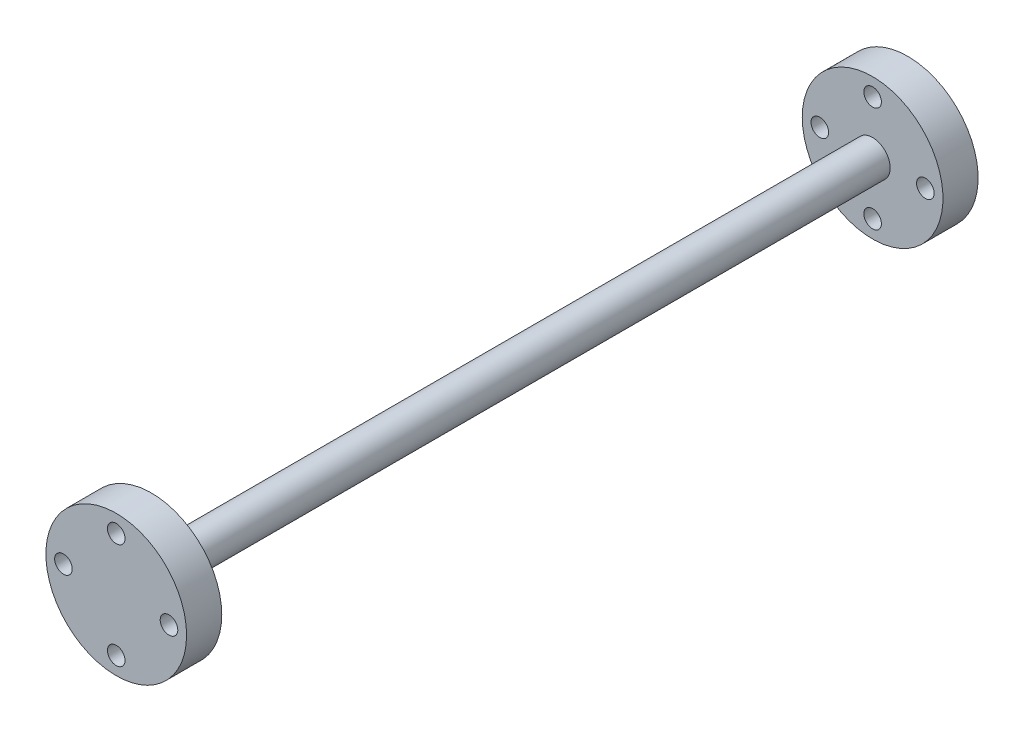
ISO-10303-21;
HEADER;
FILE_DESCRIPTION(('STEP AP214'),'2;1');
FILE_NAME('part.step','',(''),(''),'','','');
FILE_SCHEMA(('AUTOMOTIVE_DESIGN { 1 0 10303 214 1 1 1 1 }'));
ENDSEC;
DATA;
#1=APPLICATION_CONTEXT('core data for automotive mechanical design processes');
#2=APPLICATION_PROTOCOL_DEFINITION('international standard','automotive_design',2000,#1);
#3=PRODUCT_CONTEXT('',#1,'mechanical');
#4=PRODUCT('Part','Part','',(#3));
#5=PRODUCT_RELATED_PRODUCT_CATEGORY('part','',(#4));
#6=PRODUCT_DEFINITION_FORMATION('','',#4);
#7=PRODUCT_DEFINITION_CONTEXT('part definition',#1,'design');
#8=PRODUCT_DEFINITION('design','',#6,#7);
#9=PRODUCT_DEFINITION_SHAPE('','',#8);
#10=(LENGTH_UNIT() NAMED_UNIT(*) SI_UNIT(.MILLI.,.METRE.));
#11=(NAMED_UNIT(*) PLANE_ANGLE_UNIT() SI_UNIT($,.RADIAN.));
#12=(NAMED_UNIT(*) SI_UNIT($,.STERADIAN.) SOLID_ANGLE_UNIT());
#13=UNCERTAINTY_MEASURE_WITH_UNIT(LENGTH_MEASURE(1.E-05),#10,'distance_accuracy_value','');
#14=(GEOMETRIC_REPRESENTATION_CONTEXT(3) GLOBAL_UNCERTAINTY_ASSIGNED_CONTEXT((#13)) GLOBAL_UNIT_ASSIGNED_CONTEXT((#10,
#11,#12)) REPRESENTATION_CONTEXT('',''));
#15=CARTESIAN_POINT('',(0.,0.,0.));
#16=DIRECTION('',(0.,0.,1.));
#17=DIRECTION('',(1.,0.,0.));
#18=AXIS2_PLACEMENT_3D('',#15,#16,#17);
#19=CARTESIAN_POINT('',(0.,0.,-100.));
#20=DIRECTION('',(0.,0.,1.));
#21=DIRECTION('',(1.,0.,0.));
#22=AXIS2_PLACEMENT_3D('',#19,#20,#21);
#23=CYLINDRICAL_SURFACE('',#22,5.);
#24=CARTESIAN_POINT('',(0.,0.,-100.));
#25=DIRECTION('',(0.,0.,-1.));
#26=DIRECTION('',(-1.,0.,0.));
#27=AXIS2_PLACEMENT_3D('',#24,#25,#26);
#28=CIRCLE('',#27,5.);
#29=CARTESIAN_POINT('',(-5.,0.,-100.));
#30=VERTEX_POINT('',#29);
#31=EDGE_CURVE('E70',#30,#30,#28,.F.);
#32=ORIENTED_EDGE('',*,*,#31,.T.);
#33=EDGE_LOOP('',(#32));
#34=FACE_BOUND('',#33,.T.);
#35=CARTESIAN_POINT('',(0.,0.,105.));
#36=DIRECTION('',(0.,0.,1.));
#37=DIRECTION('',(1.,0.,0.));
#38=AXIS2_PLACEMENT_3D('',#35,#36,#37);
#39=CIRCLE('',#38,5.);
#40=CARTESIAN_POINT('',(5.,0.,105.));
#41=VERTEX_POINT('',#40);
#42=EDGE_CURVE('E10',#41,#41,#39,.T.);
#43=ORIENTED_EDGE('',*,*,#42,.F.);
#44=EDGE_LOOP('',(#43));
#45=FACE_BOUND('',#44,.T.);
#46=ADVANCED_FACE('F32',(#34,#45),#23,.T.);
#47=CARTESIAN_POINT('',(0.,0.,115.));
#48=DIRECTION('',(0.,0.,1.));
#49=DIRECTION('',(1.,0.,0.));
#50=AXIS2_PLACEMENT_3D('',#47,#48,#49);
#51=PLANE('',#50);
#52=CARTESIAN_POINT('',(0.,-15.,115.));
#53=DIRECTION('',(0.,0.,1.));
#54=DIRECTION('',(1.,0.,0.));
#55=AXIS2_PLACEMENT_3D('',#52,#53,#54);
#56=CIRCLE('',#55,2.5000000000001);
#57=CARTESIAN_POINT('',(2.5000000000001,-15.,115.));
#58=VERTEX_POINT('',#57);
#59=EDGE_CURVE('E58',#58,#58,#56,.T.);
#60=ORIENTED_EDGE('',*,*,#59,.F.);
#61=EDGE_LOOP('',(#60));
#62=FACE_BOUND('',#61,.T.);
#63=CARTESIAN_POINT('',(0.,15.,115.));
#64=DIRECTION('',(0.,0.,1.));
#65=DIRECTION('',(1.,0.,0.));
#66=AXIS2_PLACEMENT_3D('',#63,#64,#65);
#67=CIRCLE('',#66,2.5);
#68=CARTESIAN_POINT('',(2.5,15.,115.));
#69=VERTEX_POINT('',#68);
#70=EDGE_CURVE('E47',#69,#69,#67,.T.);
#71=ORIENTED_EDGE('',*,*,#70,.F.);
#72=EDGE_LOOP('',(#71));
#73=FACE_BOUND('',#72,.T.);
#74=CARTESIAN_POINT('',(0.,0.,115.));
#75=DIRECTION('',(0.,0.,1.));
#76=DIRECTION('',(1.,0.,0.));
#77=AXIS2_PLACEMENT_3D('',#74,#75,#76);
#78=CIRCLE('',#77,20.);
#79=CARTESIAN_POINT('',(20.,0.,115.));
#80=VERTEX_POINT('',#79);
#81=EDGE_CURVE('E38',#80,#80,#78,.T.);
#82=ORIENTED_EDGE('',*,*,#81,.T.);
#83=EDGE_LOOP('',(#82));
#84=FACE_BOUND('',#83,.T.);
#85=CARTESIAN_POINT('',(15.,0.,115.));
#86=DIRECTION('',(0.,0.,1.));
#87=DIRECTION('',(1.,0.,0.));
#88=AXIS2_PLACEMENT_3D('',#85,#86,#87);
#89=CIRCLE('',#88,2.50000000000005);
#90=CARTESIAN_POINT('',(17.5,0.,115.));
#91=VERTEX_POINT('',#90);
#92=EDGE_CURVE('E52',#91,#91,#89,.T.);
#93=ORIENTED_EDGE('',*,*,#92,.F.);
#94=EDGE_LOOP('',(#93));
#95=FACE_BOUND('',#94,.T.);
#96=CARTESIAN_POINT('',(-15.,0.,115.));
#97=DIRECTION('',(0.,0.,1.));
#98=DIRECTION('',(1.,0.,0.));
#99=AXIS2_PLACEMENT_3D('',#96,#97,#98);
#100=CIRCLE('',#99,2.50000000000015);
#101=CARTESIAN_POINT('',(-12.4999999999999,0.,115.));
#102=VERTEX_POINT('',#101);
#103=EDGE_CURVE('E64',#102,#102,#100,.T.);
#104=ORIENTED_EDGE('',*,*,#103,.F.);
#105=EDGE_LOOP('',(#104));
#106=FACE_BOUND('',#105,.T.);
#107=ADVANCED_FACE('F129',(#62,#73,#84,#95,#106),#51,.T.);
#108=CARTESIAN_POINT('',(0.,0.,105.));
#109=DIRECTION('',(0.,0.,1.));
#110=DIRECTION('',(1.,0.,0.));
#111=AXIS2_PLACEMENT_3D('',#108,#109,#110);
#112=PLANE('',#111);
#113=ORIENTED_EDGE('',*,*,#42,.T.);
#114=EDGE_LOOP('',(#113));
#115=FACE_BOUND('',#114,.T.);
#116=CARTESIAN_POINT('',(0.,0.,105.));
#117=DIRECTION('',(0.,0.,1.));
#118=DIRECTION('',(1.,0.,0.));
#119=AXIS2_PLACEMENT_3D('',#116,#117,#118);
#120=CIRCLE('',#119,20.);
#121=CARTESIAN_POINT('',(20.,0.,105.));
#122=VERTEX_POINT('',#121);
#123=EDGE_CURVE('E42',#122,#122,#120,.T.);
#124=ORIENTED_EDGE('',*,*,#123,.F.);
#125=EDGE_LOOP('',(#124));
#126=FACE_BOUND('',#125,.T.);
#127=CARTESIAN_POINT('',(0.,15.,105.));
#128=DIRECTION('',(0.,0.,1.));
#129=DIRECTION('',(1.,0.,0.));
#130=AXIS2_PLACEMENT_3D('',#127,#128,#129);
#131=CIRCLE('',#130,2.5);
#132=CARTESIAN_POINT('',(2.5,15.,105.));
#133=VERTEX_POINT('',#132);
#134=EDGE_CURVE('E49',#133,#133,#131,.T.);
#135=ORIENTED_EDGE('',*,*,#134,.T.);
#136=EDGE_LOOP('',(#135));
#137=FACE_BOUND('',#136,.T.);
#138=CARTESIAN_POINT('',(15.,0.,105.));
#139=DIRECTION('',(0.,0.,1.));
#140=DIRECTION('',(1.,0.,0.));
#141=AXIS2_PLACEMENT_3D('',#138,#139,#140);
#142=CIRCLE('',#141,2.50000000000005);
#143=CARTESIAN_POINT('',(17.5,0.,105.));
#144=VERTEX_POINT('',#143);
#145=EDGE_CURVE('E55',#144,#144,#142,.T.);
#146=ORIENTED_EDGE('',*,*,#145,.T.);
#147=EDGE_LOOP('',(#146));
#148=FACE_BOUND('',#147,.T.);
#149=CARTESIAN_POINT('',(0.,-15.,105.));
#150=DIRECTION('',(0.,0.,1.));
#151=DIRECTION('',(1.,0.,0.));
#152=AXIS2_PLACEMENT_3D('',#149,#150,#151);
#153=CIRCLE('',#152,2.5000000000001);
#154=CARTESIAN_POINT('',(2.5000000000001,-15.,105.));
#155=VERTEX_POINT('',#154);
#156=EDGE_CURVE('E61',#155,#155,#153,.T.);
#157=ORIENTED_EDGE('',*,*,#156,.T.);
#158=EDGE_LOOP('',(#157));
#159=FACE_BOUND('',#158,.T.);
#160=CARTESIAN_POINT('',(-15.,0.,105.));
#161=DIRECTION('',(0.,0.,1.));
#162=DIRECTION('',(1.,0.,0.));
#163=AXIS2_PLACEMENT_3D('',#160,#161,#162);
#164=CIRCLE('',#163,2.50000000000015);
#165=CARTESIAN_POINT('',(-12.4999999999999,0.,105.));
#166=VERTEX_POINT('',#165);
#167=EDGE_CURVE('E67',#166,#166,#164,.T.);
#168=ORIENTED_EDGE('',*,*,#167,.T.);
#169=EDGE_LOOP('',(#168));
#170=FACE_BOUND('',#169,.T.);
#171=ADVANCED_FACE('F134',(#115,#126,#137,#148,#159,#170),#112,.F.);
#172=CARTESIAN_POINT('',(0.,0.,115.));
#173=DIRECTION('',(0.,0.,-1.));
#174=DIRECTION('',(-1.,0.,0.));
#175=AXIS2_PLACEMENT_3D('',#172,#173,#174);
#176=CYLINDRICAL_SURFACE('',#175,20.);
#177=ORIENTED_EDGE('',*,*,#81,.F.);
#178=EDGE_LOOP('',(#177));
#179=FACE_BOUND('',#178,.T.);
#180=ORIENTED_EDGE('',*,*,#123,.T.);
#181=EDGE_LOOP('',(#180));
#182=FACE_BOUND('',#181,.T.);
#183=ADVANCED_FACE('F189',(#179,#182),#176,.T.);
#184=CARTESIAN_POINT('',(0.,15.,115.));
#185=DIRECTION('',(0.,0.,-1.));
#186=DIRECTION('',(-1.,0.,0.));
#187=AXIS2_PLACEMENT_3D('',#184,#185,#186);
#188=CYLINDRICAL_SURFACE('',#187,2.5);
#189=ORIENTED_EDGE('',*,*,#70,.T.);
#190=EDGE_LOOP('',(#189));
#191=FACE_BOUND('',#190,.T.);
#192=ORIENTED_EDGE('',*,*,#134,.F.);
#193=EDGE_LOOP('',(#192));
#194=FACE_BOUND('',#193,.T.);
#195=ADVANCED_FACE('F186',(#191,#194),#188,.F.);
#196=CARTESIAN_POINT('',(15.,0.,115.));
#197=DIRECTION('',(0.,0.,-1.));
#198=DIRECTION('',(-1.,0.,0.));
#199=AXIS2_PLACEMENT_3D('',#196,#197,#198);
#200=CYLINDRICAL_SURFACE('',#199,2.50000000000005);
#201=ORIENTED_EDGE('',*,*,#92,.T.);
#202=EDGE_LOOP('',(#201));
#203=FACE_BOUND('',#202,.T.);
#204=ORIENTED_EDGE('',*,*,#145,.F.);
#205=EDGE_LOOP('',(#204));
#206=FACE_BOUND('',#205,.T.);
#207=ADVANCED_FACE('F182',(#203,#206),#200,.F.);
#208=CARTESIAN_POINT('',(0.,-15.,115.));
#209=DIRECTION('',(0.,0.,-1.));
#210=DIRECTION('',(-1.,0.,0.));
#211=AXIS2_PLACEMENT_3D('',#208,#209,#210);
#212=CYLINDRICAL_SURFACE('',#211,2.5000000000001);
#213=ORIENTED_EDGE('',*,*,#59,.T.);
#214=EDGE_LOOP('',(#213));
#215=FACE_BOUND('',#214,.T.);
#216=ORIENTED_EDGE('',*,*,#156,.F.);
#217=EDGE_LOOP('',(#216));
#218=FACE_BOUND('',#217,.T.);
#219=ADVANCED_FACE('F122',(#215,#218),#212,.F.);
#220=CARTESIAN_POINT('',(-15.,0.,115.));
#221=DIRECTION('',(0.,0.,-1.));
#222=DIRECTION('',(-1.,0.,0.));
#223=AXIS2_PLACEMENT_3D('',#220,#221,#222);
#224=CYLINDRICAL_SURFACE('',#223,2.50000000000015);
#225=ORIENTED_EDGE('',*,*,#103,.T.);
#226=EDGE_LOOP('',(#225));
#227=FACE_BOUND('',#226,.T.);
#228=ORIENTED_EDGE('',*,*,#167,.F.);
#229=EDGE_LOOP('',(#228));
#230=FACE_BOUND('',#229,.T.);
#231=ADVANCED_FACE('F112',(#227,#230),#224,.F.);
#232=CARTESIAN_POINT('',(0.,0.,-110.));
#233=DIRECTION('',(0.,0.,-1.));
#234=DIRECTION('',(-1.,0.,0.));
#235=AXIS2_PLACEMENT_3D('',#232,#233,#234);
#236=PLANE('',#235);
#237=CARTESIAN_POINT('',(0.,-15.,-110.));
#238=DIRECTION('',(0.,0.,-1.));
#239=DIRECTION('',(-1.,0.,0.));
#240=AXIS2_PLACEMENT_3D('',#237,#238,#239);
#241=CIRCLE('',#240,2.5000000000001);
#242=CARTESIAN_POINT('',(-2.5000000000001,-15.,-110.));
#243=VERTEX_POINT('',#242);
#244=EDGE_CURVE('E91',#243,#243,#241,.T.);
#245=ORIENTED_EDGE('',*,*,#244,.F.);
#246=EDGE_LOOP('',(#245));
#247=FACE_BOUND('',#246,.T.);
#248=CARTESIAN_POINT('',(0.,15.,-110.));
#249=DIRECTION('',(0.,0.,-1.));
#250=DIRECTION('',(-1.,0.,0.));
#251=AXIS2_PLACEMENT_3D('',#248,#249,#250);
#252=CIRCLE('',#251,2.5);
#253=CARTESIAN_POINT('',(-2.5,15.,-110.));
#254=VERTEX_POINT('',#253);
#255=EDGE_CURVE('E79',#254,#254,#252,.T.);
#256=ORIENTED_EDGE('',*,*,#255,.F.);
#257=EDGE_LOOP('',(#256));
#258=FACE_BOUND('',#257,.T.);
#259=CARTESIAN_POINT('',(0.,0.,-110.));
#260=DIRECTION('',(0.,0.,-1.));
#261=DIRECTION('',(-1.,0.,0.));
#262=AXIS2_PLACEMENT_3D('',#259,#260,#261);
#263=CIRCLE('',#262,20.);
#264=CARTESIAN_POINT('',(-20.,0.,-110.));
#265=VERTEX_POINT('',#264);
#266=EDGE_CURVE('E75',#265,#265,#263,.T.);
#267=ORIENTED_EDGE('',*,*,#266,.T.);
#268=EDGE_LOOP('',(#267));
#269=FACE_BOUND('',#268,.T.);
#270=CARTESIAN_POINT('',(15.,0.,-110.));
#271=DIRECTION('',(0.,0.,-1.));
#272=DIRECTION('',(-1.,0.,0.));
#273=AXIS2_PLACEMENT_3D('',#270,#271,#272);
#274=CIRCLE('',#273,2.50000000000005);
#275=CARTESIAN_POINT('',(12.4999999999999,0.,-110.));
#276=VERTEX_POINT('',#275);
#277=EDGE_CURVE('E85',#276,#276,#274,.T.);
#278=ORIENTED_EDGE('',*,*,#277,.F.);
#279=EDGE_LOOP('',(#278));
#280=FACE_BOUND('',#279,.T.);
#281=CARTESIAN_POINT('',(-15.,0.,-110.));
#282=DIRECTION('',(0.,0.,-1.));
#283=DIRECTION('',(-1.,0.,0.));
#284=AXIS2_PLACEMENT_3D('',#281,#282,#283);
#285=CIRCLE('',#284,2.50000000000015);
#286=CARTESIAN_POINT('',(-17.5000000000002,0.,-110.));
#287=VERTEX_POINT('',#286);
#288=EDGE_CURVE('E97',#287,#287,#285,.T.);
#289=ORIENTED_EDGE('',*,*,#288,.F.);
#290=EDGE_LOOP('',(#289));
#291=FACE_BOUND('',#290,.T.);
#292=ADVANCED_FACE('F109',(#247,#258,#269,#280,#291),#236,.T.);
#293=CARTESIAN_POINT('',(0.,0.,-100.));
#294=DIRECTION('',(0.,0.,-1.));
#295=DIRECTION('',(-1.,0.,0.));
#296=AXIS2_PLACEMENT_3D('',#293,#294,#295);
#297=PLANE('',#296);
#298=ORIENTED_EDGE('',*,*,#31,.F.);
#299=EDGE_LOOP('',(#298));
#300=FACE_BOUND('',#299,.T.);
#301=CARTESIAN_POINT('',(0.,0.,-100.));
#302=DIRECTION('',(0.,0.,-1.));
#303=DIRECTION('',(-1.,0.,0.));
#304=AXIS2_PLACEMENT_3D('',#301,#302,#303);
#305=CIRCLE('',#304,20.);
#306=CARTESIAN_POINT('',(-20.,0.,-100.));
#307=VERTEX_POINT('',#306);
#308=EDGE_CURVE('E76',#307,#307,#305,.T.);
#309=ORIENTED_EDGE('',*,*,#308,.F.);
#310=EDGE_LOOP('',(#309));
#311=FACE_BOUND('',#310,.T.);
#312=CARTESIAN_POINT('',(0.,15.,-100.));
#313=DIRECTION('',(0.,0.,-1.));
#314=DIRECTION('',(-1.,0.,0.));
#315=AXIS2_PLACEMENT_3D('',#312,#313,#314);
#316=CIRCLE('',#315,2.5);
#317=CARTESIAN_POINT('',(-2.5,15.,-100.));
#318=VERTEX_POINT('',#317);
#319=EDGE_CURVE('E82',#318,#318,#316,.T.);
#320=ORIENTED_EDGE('',*,*,#319,.T.);
#321=EDGE_LOOP('',(#320));
#322=FACE_BOUND('',#321,.T.);
#323=CARTESIAN_POINT('',(15.,0.,-100.));
#324=DIRECTION('',(0.,0.,-1.));
#325=DIRECTION('',(-1.,0.,0.));
#326=AXIS2_PLACEMENT_3D('',#323,#324,#325);
#327=CIRCLE('',#326,2.50000000000005);
#328=CARTESIAN_POINT('',(12.4999999999999,0.,-100.));
#329=VERTEX_POINT('',#328);
#330=EDGE_CURVE('E88',#329,#329,#327,.T.);
#331=ORIENTED_EDGE('',*,*,#330,.T.);
#332=EDGE_LOOP('',(#331));
#333=FACE_BOUND('',#332,.T.);
#334=CARTESIAN_POINT('',(0.,-15.,-100.));
#335=DIRECTION('',(0.,0.,-1.));
#336=DIRECTION('',(-1.,0.,0.));
#337=AXIS2_PLACEMENT_3D('',#334,#335,#336);
#338=CIRCLE('',#337,2.5000000000001);
#339=CARTESIAN_POINT('',(-2.5000000000001,-15.,-100.));
#340=VERTEX_POINT('',#339);
#341=EDGE_CURVE('E94',#340,#340,#338,.T.);
#342=ORIENTED_EDGE('',*,*,#341,.T.);
#343=EDGE_LOOP('',(#342));
#344=FACE_BOUND('',#343,.T.);
#345=CARTESIAN_POINT('',(-15.,0.,-100.));
#346=DIRECTION('',(0.,0.,-1.));
#347=DIRECTION('',(-1.,0.,0.));
#348=AXIS2_PLACEMENT_3D('',#345,#346,#347);
#349=CIRCLE('',#348,2.50000000000015);
#350=CARTESIAN_POINT('',(-17.5000000000002,0.,-100.));
#351=VERTEX_POINT('',#350);
#352=EDGE_CURVE('E100',#351,#351,#349,.T.);
#353=ORIENTED_EDGE('',*,*,#352,.T.);
#354=EDGE_LOOP('',(#353));
#355=FACE_BOUND('',#354,.T.);
#356=ADVANCED_FACE('F111',(#300,#311,#322,#333,#344,#355),#297,.F.);
#357=CARTESIAN_POINT('',(0.,0.,-110.));
#358=DIRECTION('',(0.,0.,1.));
#359=DIRECTION('',(1.,0.,0.));
#360=AXIS2_PLACEMENT_3D('',#357,#358,#359);
#361=CYLINDRICAL_SURFACE('',#360,20.);
#362=ORIENTED_EDGE('',*,*,#266,.F.);
#363=EDGE_LOOP('',(#362));
#364=FACE_BOUND('',#363,.T.);
#365=ORIENTED_EDGE('',*,*,#308,.T.);
#366=EDGE_LOOP('',(#365));
#367=FACE_BOUND('',#366,.T.);
#368=ADVANCED_FACE('F119',(#364,#367),#361,.T.);
#369=CARTESIAN_POINT('',(0.,15.,-110.));
#370=DIRECTION('',(0.,0.,1.));
#371=DIRECTION('',(1.,0.,0.));
#372=AXIS2_PLACEMENT_3D('',#369,#370,#371);
#373=CYLINDRICAL_SURFACE('',#372,2.5);
#374=ORIENTED_EDGE('',*,*,#255,.T.);
#375=EDGE_LOOP('',(#374));
#376=FACE_BOUND('',#375,.T.);
#377=ORIENTED_EDGE('',*,*,#319,.F.);
#378=EDGE_LOOP('',(#377));
#379=FACE_BOUND('',#378,.T.);
#380=ADVANCED_FACE('F160',(#376,#379),#373,.F.);
#381=CARTESIAN_POINT('',(15.,0.,-110.));
#382=DIRECTION('',(0.,0.,1.));
#383=DIRECTION('',(1.,0.,0.));
#384=AXIS2_PLACEMENT_3D('',#381,#382,#383);
#385=CYLINDRICAL_SURFACE('',#384,2.50000000000005);
#386=ORIENTED_EDGE('',*,*,#277,.T.);
#387=EDGE_LOOP('',(#386));
#388=FACE_BOUND('',#387,.T.);
#389=ORIENTED_EDGE('',*,*,#330,.F.);
#390=EDGE_LOOP('',(#389));
#391=FACE_BOUND('',#390,.T.);
#392=ADVANCED_FACE('F155',(#388,#391),#385,.F.);
#393=CARTESIAN_POINT('',(0.,-15.,-110.));
#394=DIRECTION('',(0.,0.,1.));
#395=DIRECTION('',(1.,0.,0.));
#396=AXIS2_PLACEMENT_3D('',#393,#394,#395);
#397=CYLINDRICAL_SURFACE('',#396,2.5000000000001);
#398=ORIENTED_EDGE('',*,*,#244,.T.);
#399=EDGE_LOOP('',(#398));
#400=FACE_BOUND('',#399,.T.);
#401=ORIENTED_EDGE('',*,*,#341,.F.);
#402=EDGE_LOOP('',(#401));
#403=FACE_BOUND('',#402,.T.);
#404=ADVANCED_FACE('F150',(#400,#403),#397,.F.);
#405=CARTESIAN_POINT('',(-15.,0.,-110.));
#406=DIRECTION('',(0.,0.,1.));
#407=DIRECTION('',(1.,0.,0.));
#408=AXIS2_PLACEMENT_3D('',#405,#406,#407);
#409=CYLINDRICAL_SURFACE('',#408,2.50000000000015);
#410=ORIENTED_EDGE('',*,*,#288,.T.);
#411=EDGE_LOOP('',(#410));
#412=FACE_BOUND('',#411,.T.);
#413=ORIENTED_EDGE('',*,*,#352,.F.);
#414=EDGE_LOOP('',(#413));
#415=FACE_BOUND('',#414,.T.);
#416=ADVANCED_FACE('F106',(#412,#415),#409,.F.);
#417=CLOSED_SHELL('',(#46,#107,#171,#183,#195,#207,#219,#231,#292,#356,#368,#380,#392,#404,#416));
#418=MANIFOLD_SOLID_BREP('B2',#417);
#419=ADVANCED_BREP_SHAPE_REPRESENTATION('',(#18,#418),#14);
#420=SHAPE_DEFINITION_REPRESENTATION(#9,#419);
ENDSEC;
END-ISO-10303-21;
